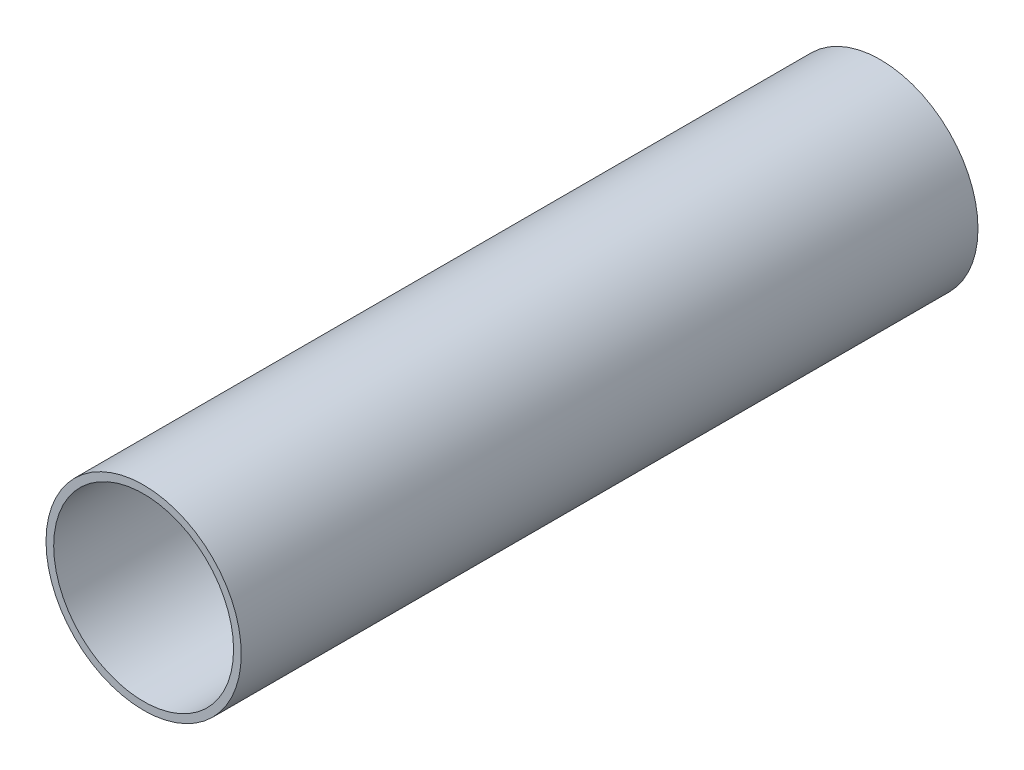
ISO-10303-21;
HEADER;
FILE_DESCRIPTION(('STEP AP214'),'2;1');
FILE_NAME('part.step','',(''),(''),'','','');
FILE_SCHEMA(('AUTOMOTIVE_DESIGN { 1 0 10303 214 1 1 1 1 }'));
ENDSEC;
DATA;
#1=APPLICATION_CONTEXT('core data for automotive mechanical design processes');
#2=APPLICATION_PROTOCOL_DEFINITION('international standard','automotive_design',2000,#1);
#3=PRODUCT_CONTEXT('',#1,'mechanical');
#4=PRODUCT('Part','Part','',(#3));
#5=PRODUCT_RELATED_PRODUCT_CATEGORY('part','',(#4));
#6=PRODUCT_DEFINITION_FORMATION('','',#4);
#7=PRODUCT_DEFINITION_CONTEXT('part definition',#1,'design');
#8=PRODUCT_DEFINITION('design','',#6,#7);
#9=PRODUCT_DEFINITION_SHAPE('','',#8);
#10=(LENGTH_UNIT() NAMED_UNIT(*) SI_UNIT(.MILLI.,.METRE.));
#11=(NAMED_UNIT(*) PLANE_ANGLE_UNIT() SI_UNIT($,.RADIAN.));
#12=(NAMED_UNIT(*) SI_UNIT($,.STERADIAN.) SOLID_ANGLE_UNIT());
#13=UNCERTAINTY_MEASURE_WITH_UNIT(LENGTH_MEASURE(1.E-05),#10,'distance_accuracy_value','');
#14=(GEOMETRIC_REPRESENTATION_CONTEXT(3) GLOBAL_UNCERTAINTY_ASSIGNED_CONTEXT((#13)) GLOBAL_UNIT_ASSIGNED_CONTEXT((#10,
#11,#12)) REPRESENTATION_CONTEXT('',''));
#15=CARTESIAN_POINT('',(0.,0.,0.));
#16=DIRECTION('',(0.,0.,1.));
#17=DIRECTION('',(1.,0.,0.));
#18=AXIS2_PLACEMENT_3D('',#15,#16,#17);
#19=CARTESIAN_POINT('',(0.,0.,-120.));
#20=DIRECTION('',(0.,0.,1.));
#21=DIRECTION('',(1.,0.,0.));
#22=AXIS2_PLACEMENT_3D('',#19,#20,#21);
#23=CYLINDRICAL_SURFACE('',#22,15.9);
#24=CARTESIAN_POINT('',(0.,0.,-120.));
#25=DIRECTION('',(0.,0.,1.));
#26=DIRECTION('',(1.,0.,0.));
#27=AXIS2_PLACEMENT_3D('',#24,#25,#26);
#28=CIRCLE('',#27,15.9);
#29=CARTESIAN_POINT('',(15.9,0.,-120.));
#30=VERTEX_POINT('',#29);
#31=EDGE_CURVE('E10',#30,#30,#28,.T.);
#32=ORIENTED_EDGE('',*,*,#31,.T.);
#33=EDGE_LOOP('',(#32));
#34=FACE_BOUND('',#33,.T.);
#35=CARTESIAN_POINT('',(0.,0.,0.));
#36=DIRECTION('',(0.,0.,1.));
#37=DIRECTION('',(1.,0.,0.));
#38=AXIS2_PLACEMENT_3D('',#35,#36,#37);
#39=CIRCLE('',#38,15.9);
#40=CARTESIAN_POINT('',(15.9,0.,0.));
#41=VERTEX_POINT('',#40);
#42=EDGE_CURVE('E44',#41,#41,#39,.T.);
#43=ORIENTED_EDGE('',*,*,#42,.F.);
#44=EDGE_LOOP('',(#43));
#45=FACE_BOUND('',#44,.T.);
#46=ADVANCED_FACE('F41',(#34,#45),#23,.T.);
#47=CARTESIAN_POINT('',(0.,0.,-120.));
#48=DIRECTION('',(0.,0.,1.));
#49=DIRECTION('',(1.,0.,0.));
#50=AXIS2_PLACEMENT_3D('',#47,#48,#49);
#51=PLANE('',#50);
#52=CARTESIAN_POINT('',(0.,0.,-120.));
#53=DIRECTION('',(0.,0.,1.));
#54=DIRECTION('',(1.,0.,0.));
#55=AXIS2_PLACEMENT_3D('',#52,#53,#54);
#56=CIRCLE('',#55,14.65);
#57=CARTESIAN_POINT('',(14.65,0.,-120.));
#58=VERTEX_POINT('',#57);
#59=EDGE_CURVE('E53',#58,#58,#56,.T.);
#60=ORIENTED_EDGE('',*,*,#59,.T.);
#61=EDGE_LOOP('',(#60));
#62=FACE_BOUND('',#61,.T.);
#63=ORIENTED_EDGE('',*,*,#31,.F.);
#64=EDGE_LOOP('',(#63));
#65=FACE_BOUND('',#64,.T.);
#66=ADVANCED_FACE('F63',(#62,#65),#51,.F.);
#67=CARTESIAN_POINT('',(0.,0.,0.));
#68=DIRECTION('',(0.,0.,1.));
#69=DIRECTION('',(1.,0.,0.));
#70=AXIS2_PLACEMENT_3D('',#67,#68,#69);
#71=PLANE('',#70);
#72=CARTESIAN_POINT('',(0.,0.,0.));
#73=DIRECTION('',(0.,0.,1.));
#74=DIRECTION('',(1.,0.,0.));
#75=AXIS2_PLACEMENT_3D('',#72,#73,#74);
#76=CIRCLE('',#75,14.65);
#77=CARTESIAN_POINT('',(14.65,0.,0.));
#78=VERTEX_POINT('',#77);
#79=EDGE_CURVE('E55',#78,#78,#76,.T.);
#80=ORIENTED_EDGE('',*,*,#79,.F.);
#81=EDGE_LOOP('',(#80));
#82=FACE_BOUND('',#81,.T.);
#83=ORIENTED_EDGE('',*,*,#42,.T.);
#84=EDGE_LOOP('',(#83));
#85=FACE_BOUND('',#84,.T.);
#86=ADVANCED_FACE('F69',(#82,#85),#71,.T.);
#87=CARTESIAN_POINT('',(0.,0.,-120.));
#88=DIRECTION('',(0.,0.,1.));
#89=DIRECTION('',(1.,0.,0.));
#90=AXIS2_PLACEMENT_3D('',#87,#88,#89);
#91=CYLINDRICAL_SURFACE('',#90,14.65);
#92=ORIENTED_EDGE('',*,*,#59,.F.);
#93=EDGE_LOOP('',(#92));
#94=FACE_BOUND('',#93,.T.);
#95=ORIENTED_EDGE('',*,*,#79,.T.);
#96=EDGE_LOOP('',(#95));
#97=FACE_BOUND('',#96,.T.);
#98=ADVANCED_FACE('F66',(#94,#97),#91,.F.);
#99=CLOSED_SHELL('',(#46,#66,#86,#98));
#100=MANIFOLD_SOLID_BREP('B2',#99);
#101=ADVANCED_BREP_SHAPE_REPRESENTATION('',(#18,#100),#14);
#102=SHAPE_DEFINITION_REPRESENTATION(#9,#101);
ENDSEC;
END-ISO-10303-21;
